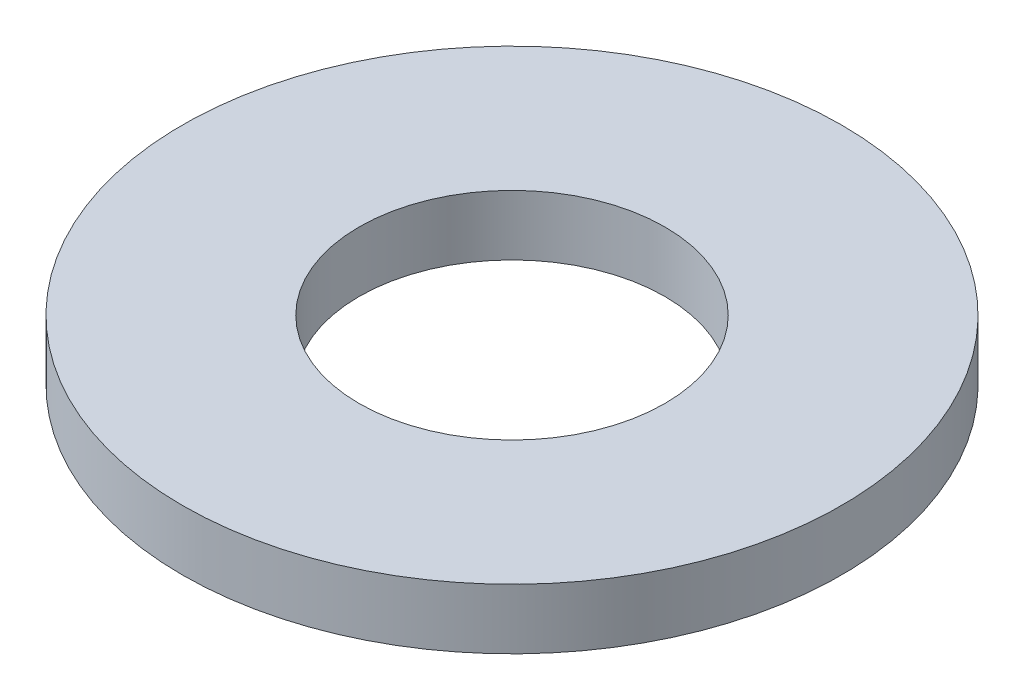
ISO-10303-21;
HEADER;
FILE_DESCRIPTION(('STEP AP214'),'2;1');
FILE_NAME('part.step','',(''),(''),'','','');
FILE_SCHEMA(('AUTOMOTIVE_DESIGN { 1 0 10303 214 1 1 1 1 }'));
ENDSEC;
DATA;
#1=APPLICATION_CONTEXT('core data for automotive mechanical design processes');
#2=APPLICATION_PROTOCOL_DEFINITION('international standard','automotive_design',2000,#1);
#3=PRODUCT_CONTEXT('',#1,'mechanical');
#4=PRODUCT('Part','Part','',(#3));
#5=PRODUCT_RELATED_PRODUCT_CATEGORY('part','',(#4));
#6=PRODUCT_DEFINITION_FORMATION('','',#4);
#7=PRODUCT_DEFINITION_CONTEXT('part definition',#1,'design');
#8=PRODUCT_DEFINITION('design','',#6,#7);
#9=PRODUCT_DEFINITION_SHAPE('','',#8);
#10=(LENGTH_UNIT() NAMED_UNIT(*) SI_UNIT(.MILLI.,.METRE.));
#11=(NAMED_UNIT(*) PLANE_ANGLE_UNIT() SI_UNIT($,.RADIAN.));
#12=(NAMED_UNIT(*) SI_UNIT($,.STERADIAN.) SOLID_ANGLE_UNIT());
#13=UNCERTAINTY_MEASURE_WITH_UNIT(LENGTH_MEASURE(1.E-05),#10,'distance_accuracy_value','');
#14=(GEOMETRIC_REPRESENTATION_CONTEXT(3) GLOBAL_UNCERTAINTY_ASSIGNED_CONTEXT((#13)) GLOBAL_UNIT_ASSIGNED_CONTEXT((#10,
#11,#12)) REPRESENTATION_CONTEXT('',''));
#15=CARTESIAN_POINT('',(0.,0.,0.));
#16=DIRECTION('',(0.,0.,1.));
#17=DIRECTION('',(1.,0.,0.));
#18=AXIS2_PLACEMENT_3D('',#15,#16,#17);
#19=CARTESIAN_POINT('',(0.,1.016,0.));
#20=DIRECTION('',(0.,-1.,0.));
#21=DIRECTION('',(0.,0.,-1.));
#22=AXIS2_PLACEMENT_3D('',#19,#20,#21);
#23=CYLINDRICAL_SURFACE('',#22,5.55625);
#24=CARTESIAN_POINT('',(0.,1.016,0.));
#25=DIRECTION('',(0.,1.,0.));
#26=DIRECTION('',(0.,0.,1.));
#27=AXIS2_PLACEMENT_3D('',#24,#25,#26);
#28=CIRCLE('',#27,5.55625);
#29=CARTESIAN_POINT('',(0.,1.016,5.55625));
#30=VERTEX_POINT('',#29);
#31=EDGE_CURVE('E10',#30,#30,#28,.T.);
#32=ORIENTED_EDGE('',*,*,#31,.F.);
#33=EDGE_LOOP('',(#32));
#34=FACE_BOUND('',#33,.T.);
#35=CARTESIAN_POINT('',(0.,0.,0.));
#36=DIRECTION('',(0.,1.,0.));
#37=DIRECTION('',(0.,0.,1.));
#38=AXIS2_PLACEMENT_3D('',#35,#36,#37);
#39=CIRCLE('',#38,5.55625);
#40=CARTESIAN_POINT('',(0.,0.,5.55625));
#41=VERTEX_POINT('',#40);
#42=EDGE_CURVE('E31',#41,#41,#39,.T.);
#43=ORIENTED_EDGE('',*,*,#42,.T.);
#44=EDGE_LOOP('',(#43));
#45=FACE_BOUND('',#44,.T.);
#46=ADVANCED_FACE('F28',(#34,#45),#23,.T.);
#47=CARTESIAN_POINT('',(0.,1.016,0.));
#48=DIRECTION('',(0.,1.,0.));
#49=DIRECTION('',(0.,0.,1.));
#50=AXIS2_PLACEMENT_3D('',#47,#48,#49);
#51=PLANE('',#50);
#52=CARTESIAN_POINT('',(0.,1.016,0.));
#53=DIRECTION('',(0.,1.,0.));
#54=DIRECTION('',(0.,0.,1.));
#55=AXIS2_PLACEMENT_3D('',#52,#53,#54);
#56=CIRCLE('',#55,2.5781);
#57=CARTESIAN_POINT('',(0.,1.016,2.5781));
#58=VERTEX_POINT('',#57);
#59=EDGE_CURVE('E40',#58,#58,#56,.T.);
#60=ORIENTED_EDGE('',*,*,#59,.F.);
#61=EDGE_LOOP('',(#60));
#62=FACE_BOUND('',#61,.T.);
#63=ORIENTED_EDGE('',*,*,#31,.T.);
#64=EDGE_LOOP('',(#63));
#65=FACE_BOUND('',#64,.T.);
#66=ADVANCED_FACE('F55',(#62,#65),#51,.T.);
#67=CARTESIAN_POINT('',(0.,0.,0.));
#68=DIRECTION('',(0.,1.,0.));
#69=DIRECTION('',(0.,0.,1.));
#70=AXIS2_PLACEMENT_3D('',#67,#68,#69);
#71=PLANE('',#70);
#72=CARTESIAN_POINT('',(0.,0.,0.));
#73=DIRECTION('',(0.,1.,0.));
#74=DIRECTION('',(0.,0.,1.));
#75=AXIS2_PLACEMENT_3D('',#72,#73,#74);
#76=CIRCLE('',#75,2.5781);
#77=CARTESIAN_POINT('',(0.,0.,2.5781));
#78=VERTEX_POINT('',#77);
#79=EDGE_CURVE('E38',#78,#78,#76,.T.);
#80=ORIENTED_EDGE('',*,*,#79,.T.);
#81=EDGE_LOOP('',(#80));
#82=FACE_BOUND('',#81,.T.);
#83=ORIENTED_EDGE('',*,*,#42,.F.);
#84=EDGE_LOOP('',(#83));
#85=FACE_BOUND('',#84,.T.);
#86=ADVANCED_FACE('F46',(#82,#85),#71,.F.);
#87=CARTESIAN_POINT('',(0.,0.,0.));
#88=DIRECTION('',(0.,1.,0.));
#89=DIRECTION('',(0.,0.,1.));
#90=AXIS2_PLACEMENT_3D('',#87,#88,#89);
#91=CYLINDRICAL_SURFACE('',#90,2.5781);
#92=ORIENTED_EDGE('',*,*,#79,.F.);
#93=EDGE_LOOP('',(#92));
#94=FACE_BOUND('',#93,.T.);
#95=ORIENTED_EDGE('',*,*,#59,.T.);
#96=EDGE_LOOP('',(#95));
#97=FACE_BOUND('',#96,.T.);
#98=ADVANCED_FACE('F49',(#94,#97),#91,.F.);
#99=CLOSED_SHELL('',(#46,#66,#86,#98));
#100=MANIFOLD_SOLID_BREP('B2',#99);
#101=ADVANCED_BREP_SHAPE_REPRESENTATION('',(#18,#100),#14);
#102=SHAPE_DEFINITION_REPRESENTATION(#9,#101);
ENDSEC;
END-ISO-10303-21;
